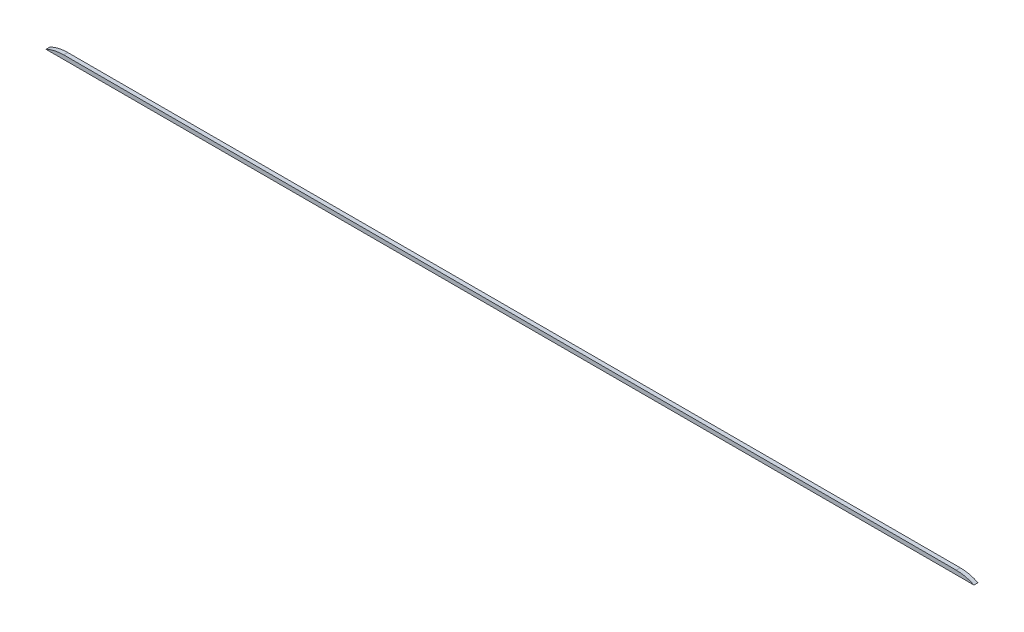
ISO-10303-21;
HEADER;
FILE_DESCRIPTION(('STEP AP214'),'2;1');
FILE_NAME('part.step','',(''),(''),'','','');
FILE_SCHEMA(('AUTOMOTIVE_DESIGN { 1 0 10303 214 1 1 1 1 }'));
ENDSEC;
DATA;
#1=APPLICATION_CONTEXT('core data for automotive mechanical design processes');
#2=APPLICATION_PROTOCOL_DEFINITION('international standard','automotive_design',2000,#1);
#3=PRODUCT_CONTEXT('',#1,'mechanical');
#4=PRODUCT('Part','Part','',(#3));
#5=PRODUCT_RELATED_PRODUCT_CATEGORY('part','',(#4));
#6=PRODUCT_DEFINITION_FORMATION('','',#4);
#7=PRODUCT_DEFINITION_CONTEXT('part definition',#1,'design');
#8=PRODUCT_DEFINITION('design','',#6,#7);
#9=PRODUCT_DEFINITION_SHAPE('','',#8);
#10=(LENGTH_UNIT() NAMED_UNIT(*) SI_UNIT(.MILLI.,.METRE.));
#11=(NAMED_UNIT(*) PLANE_ANGLE_UNIT() SI_UNIT($,.RADIAN.));
#12=(NAMED_UNIT(*) SI_UNIT($,.STERADIAN.) SOLID_ANGLE_UNIT());
#13=UNCERTAINTY_MEASURE_WITH_UNIT(LENGTH_MEASURE(1.E-05),#10,'distance_accuracy_value','');
#14=(GEOMETRIC_REPRESENTATION_CONTEXT(3) GLOBAL_UNCERTAINTY_ASSIGNED_CONTEXT((#13)) GLOBAL_UNIT_ASSIGNED_CONTEXT((#10,
#11,#12)) REPRESENTATION_CONTEXT('',''));
#15=CARTESIAN_POINT('',(0.,0.,0.));
#16=DIRECTION('',(0.,0.,1.));
#17=DIRECTION('',(1.,0.,0.));
#18=AXIS2_PLACEMENT_3D('',#15,#16,#17);
#19=CARTESIAN_POINT('',(0.,45.,0.));
#20=DIRECTION('',(0.,-1.,0.));
#21=DIRECTION('',(0.,0.,-1.));
#22=AXIS2_PLACEMENT_3D('',#19,#20,#21);
#23=PLANE('',#22);
#24=DIRECTION('',(0.,0.,-1.));
#25=VECTOR('',#24,1.);
#26=CARTESIAN_POINT('',(-524.528236675635,45.,80.));
#27=LINE('',#26,#25);
#28=CARTESIAN_POINT('',(-524.528236675635,45.,5.));
#29=VERTEX_POINT('',#28);
#30=CARTESIAN_POINT('',(-524.528236675635,45.,0.));
#31=VERTEX_POINT('',#30);
#32=EDGE_CURVE('E90',#29,#31,#27,.T.);
#33=ORIENTED_EDGE('',*,*,#32,.T.);
#34=DIRECTION('',(1.,0.,0.));
#35=VECTOR('',#34,1.);
#36=CARTESIAN_POINT('',(-502.733741957931,45.,0.));
#37=LINE('',#36,#35);
#38=CARTESIAN_POINT('',(619.060752759772,45.,0.));
#39=VERTEX_POINT('',#38);
#40=EDGE_CURVE('E80',#31,#39,#37,.T.);
#41=ORIENTED_EDGE('',*,*,#40,.T.);
#42=DIRECTION('',(0.,0.,-1.));
#43=VECTOR('',#42,1.);
#44=CARTESIAN_POINT('',(619.060752759772,45.,80.));
#45=LINE('',#44,#43);
#46=CARTESIAN_POINT('',(619.060752759772,45.,5.));
#47=VERTEX_POINT('',#46);
#48=EDGE_CURVE('E88',#39,#47,#45,.F.);
#49=ORIENTED_EDGE('',*,*,#48,.T.);
#50=DIRECTION('',(1.,0.,0.));
#51=VECTOR('',#50,1.);
#52=CARTESIAN_POINT('',(597.266258042068,45.,5.));
#53=LINE('',#52,#51);
#54=EDGE_CURVE('E91',#29,#47,#53,.T.);
#55=ORIENTED_EDGE('',*,*,#54,.F.);
#56=EDGE_LOOP('',(#33,#41,#49,#55));
#57=FACE_BOUND('',#56,.T.);
#58=ADVANCED_FACE('F34',(#57),#23,.T.);
#59=CARTESIAN_POINT('',(-502.733741957931,0.,0.));
#60=DIRECTION('',(0.,0.,1.));
#61=DIRECTION('',(1.,0.,0.));
#62=AXIS2_PLACEMENT_3D('',#59,#60,#61);
#63=PLANE('',#62);
#64=ORIENTED_EDGE('',*,*,#40,.F.);
#65=CARTESIAN_POINT('',(-502.733741957931,0.,0.));
#66=DIRECTION('',(0.,0.,1.));
#67=DIRECTION('',(1.,0.,0.));
#68=AXIS2_PLACEMENT_3D('',#65,#66,#67);
#69=CIRCLE('',#68,50.);
#70=CARTESIAN_POINT('',(-502.733741957931,50.,0.));
#71=VERTEX_POINT('',#70);
#72=EDGE_CURVE('E98',#71,#31,#69,.T.);
#73=ORIENTED_EDGE('',*,*,#72,.F.);
#74=DIRECTION('',(-1.,0.,0.));
#75=VECTOR('',#74,1.);
#76=CARTESIAN_POINT('',(-502.733741957931,50.,0.));
#77=LINE('',#76,#75);
#78=CARTESIAN_POINT('',(597.266258042068,50.,0.));
#79=VERTEX_POINT('',#78);
#80=EDGE_CURVE('E83',#79,#71,#77,.T.);
#81=ORIENTED_EDGE('',*,*,#80,.F.);
#82=CARTESIAN_POINT('',(597.266258042068,0.,0.));
#83=DIRECTION('',(0.,0.,1.));
#84=DIRECTION('',(1.,0.,0.));
#85=AXIS2_PLACEMENT_3D('',#82,#83,#84);
#86=CIRCLE('',#85,50.);
#87=EDGE_CURVE('E38',#39,#79,#86,.T.);
#88=ORIENTED_EDGE('',*,*,#87,.F.);
#89=EDGE_LOOP('',(#64,#73,#81,#88));
#90=FACE_BOUND('',#89,.T.);
#91=ADVANCED_FACE('F79',(#90),#63,.F.);
#92=CARTESIAN_POINT('',(-502.733741957931,50.,80.));
#93=DIRECTION('',(0.,-1.,0.));
#94=DIRECTION('',(0.,0.,-1.));
#95=AXIS2_PLACEMENT_3D('',#92,#93,#94);
#96=PLANE('',#95);
#97=DIRECTION('',(0.,0.,-1.));
#98=VECTOR('',#97,1.);
#99=CARTESIAN_POINT('',(-502.733741957931,50.,80.));
#100=LINE('',#99,#98);
#101=CARTESIAN_POINT('',(-502.733741957931,50.,5.));
#102=VERTEX_POINT('',#101);
#103=EDGE_CURVE('E43',#102,#71,#100,.T.);
#104=ORIENTED_EDGE('',*,*,#103,.F.);
#105=DIRECTION('',(1.,0.,0.));
#106=VECTOR('',#105,1.);
#107=CARTESIAN_POINT('',(-502.733741957931,50.,5.));
#108=LINE('',#107,#106);
#109=CARTESIAN_POINT('',(597.266258042068,50.,5.));
#110=VERTEX_POINT('',#109);
#111=EDGE_CURVE('E84',#102,#110,#108,.T.);
#112=ORIENTED_EDGE('',*,*,#111,.T.);
#113=DIRECTION('',(0.,0.,-1.));
#114=VECTOR('',#113,1.);
#115=CARTESIAN_POINT('',(597.266258042068,50.,80.));
#116=LINE('',#115,#114);
#117=EDGE_CURVE('E11',#110,#79,#116,.T.);
#118=ORIENTED_EDGE('',*,*,#117,.T.);
#119=ORIENTED_EDGE('',*,*,#80,.T.);
#120=EDGE_LOOP('',(#104,#112,#118,#119));
#121=FACE_BOUND('',#120,.T.);
#122=ADVANCED_FACE('F103',(#121),#96,.F.);
#123=CARTESIAN_POINT('',(597.266258042068,0.,80.));
#124=DIRECTION('',(0.,0.,-1.));
#125=DIRECTION('',(-1.,0.,0.));
#126=AXIS2_PLACEMENT_3D('',#123,#124,#125);
#127=CYLINDRICAL_SURFACE('',#126,50.);
#128=ORIENTED_EDGE('',*,*,#48,.F.);
#129=ORIENTED_EDGE('',*,*,#87,.T.);
#130=ORIENTED_EDGE('',*,*,#117,.F.);
#131=CARTESIAN_POINT('',(597.266258042068,0.,5.));
#132=DIRECTION('',(0.,0.,1.));
#133=DIRECTION('',(1.,0.,0.));
#134=AXIS2_PLACEMENT_3D('',#131,#132,#133);
#135=CIRCLE('',#134,50.);
#136=EDGE_CURVE('E85',#47,#110,#135,.T.);
#137=ORIENTED_EDGE('',*,*,#136,.F.);
#138=EDGE_LOOP('',(#128,#129,#130,#137));
#139=FACE_BOUND('',#138,.T.);
#140=ADVANCED_FACE('F93',(#139),#127,.T.);
#141=CARTESIAN_POINT('',(-502.733741957931,0.,80.));
#142=DIRECTION('',(0.,0.,-1.));
#143=DIRECTION('',(-1.,0.,0.));
#144=AXIS2_PLACEMENT_3D('',#141,#142,#143);
#145=CYLINDRICAL_SURFACE('',#144,50.);
#146=ORIENTED_EDGE('',*,*,#32,.F.);
#147=CARTESIAN_POINT('',(-502.733741957931,0.,5.));
#148=DIRECTION('',(0.,0.,1.));
#149=DIRECTION('',(1.,0.,0.));
#150=AXIS2_PLACEMENT_3D('',#147,#148,#149);
#151=CIRCLE('',#150,50.);
#152=EDGE_CURVE('E57',#102,#29,#151,.T.);
#153=ORIENTED_EDGE('',*,*,#152,.F.);
#154=ORIENTED_EDGE('',*,*,#103,.T.);
#155=ORIENTED_EDGE('',*,*,#72,.T.);
#156=EDGE_LOOP('',(#146,#153,#154,#155));
#157=FACE_BOUND('',#156,.T.);
#158=ADVANCED_FACE('F108',(#157),#145,.T.);
#159=CARTESIAN_POINT('',(597.266258042068,-45.,5.));
#160=DIRECTION('',(0.,0.,1.));
#161=DIRECTION('',(1.,0.,0.));
#162=AXIS2_PLACEMENT_3D('',#159,#160,#161);
#163=PLANE('',#162);
#164=ORIENTED_EDGE('',*,*,#152,.T.);
#165=ORIENTED_EDGE('',*,*,#54,.T.);
#166=ORIENTED_EDGE('',*,*,#136,.T.);
#167=ORIENTED_EDGE('',*,*,#111,.F.);
#168=EDGE_LOOP('',(#164,#165,#166,#167));
#169=FACE_BOUND('',#168,.T.);
#170=ADVANCED_FACE('F36',(#169),#163,.T.);
#171=CLOSED_SHELL('',(#58,#91,#122,#140,#158,#170));
#172=MANIFOLD_SOLID_BREP('B2',#171);
#173=ADVANCED_BREP_SHAPE_REPRESENTATION('',(#18,#172),#14);
#174=SHAPE_DEFINITION_REPRESENTATION(#9,#173);
ENDSEC;
END-ISO-10303-21;
